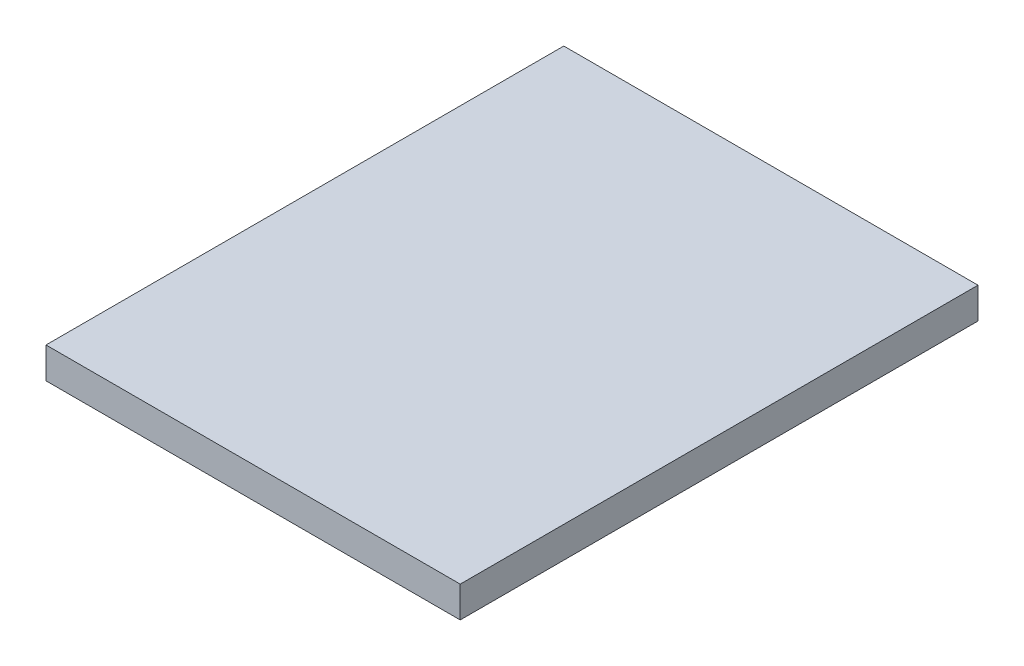
ISO-10303-21;
HEADER;
FILE_DESCRIPTION(('STEP AP214'),'2;1');
FILE_NAME('part.step','',(''),(''),'','','');
FILE_SCHEMA(('AUTOMOTIVE_DESIGN { 1 0 10303 214 1 1 1 1 }'));
ENDSEC;
DATA;
#1=APPLICATION_CONTEXT('core data for automotive mechanical design processes');
#2=APPLICATION_PROTOCOL_DEFINITION('international standard','automotive_design',2000,#1);
#3=PRODUCT_CONTEXT('',#1,'mechanical');
#4=PRODUCT('Part','Part','',(#3));
#5=PRODUCT_RELATED_PRODUCT_CATEGORY('part','',(#4));
#6=PRODUCT_DEFINITION_FORMATION('','',#4);
#7=PRODUCT_DEFINITION_CONTEXT('part definition',#1,'design');
#8=PRODUCT_DEFINITION('design','',#6,#7);
#9=PRODUCT_DEFINITION_SHAPE('','',#8);
#10=(LENGTH_UNIT() NAMED_UNIT(*) SI_UNIT(.MILLI.,.METRE.));
#11=(NAMED_UNIT(*) PLANE_ANGLE_UNIT() SI_UNIT($,.RADIAN.));
#12=(NAMED_UNIT(*) SI_UNIT($,.STERADIAN.) SOLID_ANGLE_UNIT());
#13=UNCERTAINTY_MEASURE_WITH_UNIT(LENGTH_MEASURE(1.E-05),#10,'distance_accuracy_value','');
#14=(GEOMETRIC_REPRESENTATION_CONTEXT(3) GLOBAL_UNCERTAINTY_ASSIGNED_CONTEXT((#13)) GLOBAL_UNIT_ASSIGNED_CONTEXT((#10,
#11,#12)) REPRESENTATION_CONTEXT('',''));
#15=CARTESIAN_POINT('',(0.,0.,0.));
#16=DIRECTION('',(0.,0.,1.));
#17=DIRECTION('',(1.,0.,0.));
#18=AXIS2_PLACEMENT_3D('',#15,#16,#17);
#19=CARTESIAN_POINT('',(0.,6.,0.));
#20=DIRECTION('',(1.,0.,0.));
#21=DIRECTION('',(0.,0.,-1.));
#22=AXIS2_PLACEMENT_3D('',#19,#20,#21);
#23=PLANE('',#22);
#24=DIRECTION('',(0.,0.,1.));
#25=VECTOR('',#24,1.);
#26=CARTESIAN_POINT('',(0.,0.,0.));
#27=LINE('',#26,#25);
#28=CARTESIAN_POINT('',(0.,0.,-100.));
#29=VERTEX_POINT('',#28);
#30=CARTESIAN_POINT('',(0.,0.,0.));
#31=VERTEX_POINT('',#30);
#32=EDGE_CURVE('E97',#29,#31,#27,.T.);
#33=ORIENTED_EDGE('',*,*,#32,.T.);
#34=DIRECTION('',(0.,-1.,0.));
#35=VECTOR('',#34,1.);
#36=CARTESIAN_POINT('',(0.,6.,0.));
#37=LINE('',#36,#35);
#38=CARTESIAN_POINT('',(0.,6.,0.));
#39=VERTEX_POINT('',#38);
#40=EDGE_CURVE('E11',#39,#31,#37,.T.);
#41=ORIENTED_EDGE('',*,*,#40,.F.);
#42=DIRECTION('',(0.,0.,1.));
#43=VECTOR('',#42,1.);
#44=CARTESIAN_POINT('',(0.,6.,0.));
#45=LINE('',#44,#43);
#46=CARTESIAN_POINT('',(0.,6.,-100.));
#47=VERTEX_POINT('',#46);
#48=EDGE_CURVE('E85',#47,#39,#45,.T.);
#49=ORIENTED_EDGE('',*,*,#48,.F.);
#50=DIRECTION('',(0.,-1.,0.));
#51=VECTOR('',#50,1.);
#52=CARTESIAN_POINT('',(0.,6.,-100.));
#53=LINE('',#52,#51);
#54=EDGE_CURVE('E93',#47,#29,#53,.T.);
#55=ORIENTED_EDGE('',*,*,#54,.T.);
#56=EDGE_LOOP('',(#33,#41,#49,#55));
#57=FACE_BOUND('',#56,.T.);
#58=ADVANCED_FACE('F34',(#57),#23,.F.);
#59=CARTESIAN_POINT('',(0.,6.,0.));
#60=DIRECTION('',(0.,0.,-1.));
#61=DIRECTION('',(-1.,0.,0.));
#62=AXIS2_PLACEMENT_3D('',#59,#60,#61);
#63=PLANE('',#62);
#64=DIRECTION('',(1.,0.,0.));
#65=VECTOR('',#64,1.);
#66=CARTESIAN_POINT('',(0.,0.,0.));
#67=LINE('',#66,#65);
#68=CARTESIAN_POINT('',(80.,0.,0.));
#69=VERTEX_POINT('',#68);
#70=EDGE_CURVE('E89',#31,#69,#67,.T.);
#71=ORIENTED_EDGE('',*,*,#70,.T.);
#72=DIRECTION('',(0.,-1.,0.));
#73=VECTOR('',#72,1.);
#74=CARTESIAN_POINT('',(80.,6.,0.));
#75=LINE('',#74,#73);
#76=CARTESIAN_POINT('',(80.,6.,0.));
#77=VERTEX_POINT('',#76);
#78=EDGE_CURVE('E42',#77,#69,#75,.T.);
#79=ORIENTED_EDGE('',*,*,#78,.F.);
#80=DIRECTION('',(1.,0.,0.));
#81=VECTOR('',#80,1.);
#82=CARTESIAN_POINT('',(0.,6.,0.));
#83=LINE('',#82,#81);
#84=EDGE_CURVE('E80',#39,#77,#83,.T.);
#85=ORIENTED_EDGE('',*,*,#84,.F.);
#86=ORIENTED_EDGE('',*,*,#40,.T.);
#87=EDGE_LOOP('',(#71,#79,#85,#86));
#88=FACE_BOUND('',#87,.T.);
#89=ADVANCED_FACE('F88',(#88),#63,.F.);
#90=CARTESIAN_POINT('',(80.,6.,0.));
#91=DIRECTION('',(-1.,0.,0.));
#92=DIRECTION('',(0.,0.,1.));
#93=AXIS2_PLACEMENT_3D('',#90,#91,#92);
#94=PLANE('',#93);
#95=DIRECTION('',(0.,0.,-1.));
#96=VECTOR('',#95,1.);
#97=CARTESIAN_POINT('',(80.,0.,0.));
#98=LINE('',#97,#96);
#99=CARTESIAN_POINT('',(80.,0.,-100.));
#100=VERTEX_POINT('',#99);
#101=EDGE_CURVE('E67',#69,#100,#98,.T.);
#102=ORIENTED_EDGE('',*,*,#101,.T.);
#103=DIRECTION('',(0.,-1.,0.));
#104=VECTOR('',#103,1.);
#105=CARTESIAN_POINT('',(80.,6.,-100.));
#106=LINE('',#105,#104);
#107=CARTESIAN_POINT('',(80.,6.,-100.));
#108=VERTEX_POINT('',#107);
#109=EDGE_CURVE('E90',#108,#100,#106,.T.);
#110=ORIENTED_EDGE('',*,*,#109,.F.);
#111=DIRECTION('',(0.,0.,-1.));
#112=VECTOR('',#111,1.);
#113=CARTESIAN_POINT('',(80.,6.,0.));
#114=LINE('',#113,#112);
#115=EDGE_CURVE('E83',#77,#108,#114,.T.);
#116=ORIENTED_EDGE('',*,*,#115,.F.);
#117=ORIENTED_EDGE('',*,*,#78,.T.);
#118=EDGE_LOOP('',(#102,#110,#116,#117));
#119=FACE_BOUND('',#118,.T.);
#120=ADVANCED_FACE('F91',(#119),#94,.F.);
#121=CARTESIAN_POINT('',(0.,6.,-100.));
#122=DIRECTION('',(0.,0.,1.));
#123=DIRECTION('',(1.,0.,0.));
#124=AXIS2_PLACEMENT_3D('',#121,#122,#123);
#125=PLANE('',#124);
#126=DIRECTION('',(-1.,0.,0.));
#127=VECTOR('',#126,1.);
#128=CARTESIAN_POINT('',(0.,0.,-100.));
#129=LINE('',#128,#127);
#130=EDGE_CURVE('E73',#100,#29,#129,.T.);
#131=ORIENTED_EDGE('',*,*,#130,.T.);
#132=ORIENTED_EDGE('',*,*,#54,.F.);
#133=DIRECTION('',(-1.,0.,0.));
#134=VECTOR('',#133,1.);
#135=CARTESIAN_POINT('',(0.,6.,-100.));
#136=LINE('',#135,#134);
#137=EDGE_CURVE('E50',#108,#47,#136,.T.);
#138=ORIENTED_EDGE('',*,*,#137,.F.);
#139=ORIENTED_EDGE('',*,*,#109,.T.);
#140=EDGE_LOOP('',(#131,#132,#138,#139));
#141=FACE_BOUND('',#140,.T.);
#142=ADVANCED_FACE('F104',(#141),#125,.F.);
#143=CARTESIAN_POINT('',(0.,6.,0.));
#144=DIRECTION('',(0.,-1.,0.));
#145=DIRECTION('',(0.,0.,-1.));
#146=AXIS2_PLACEMENT_3D('',#143,#144,#145);
#147=PLANE('',#146);
#148=ORIENTED_EDGE('',*,*,#48,.T.);
#149=ORIENTED_EDGE('',*,*,#84,.T.);
#150=ORIENTED_EDGE('',*,*,#115,.T.);
#151=ORIENTED_EDGE('',*,*,#137,.T.);
#152=EDGE_LOOP('',(#148,#149,#150,#151));
#153=FACE_BOUND('',#152,.T.);
#154=ADVANCED_FACE('F81',(#153),#147,.F.);
#155=CARTESIAN_POINT('',(0.,0.,0.));
#156=DIRECTION('',(0.,-1.,0.));
#157=DIRECTION('',(0.,0.,-1.));
#158=AXIS2_PLACEMENT_3D('',#155,#156,#157);
#159=PLANE('',#158);
#160=ORIENTED_EDGE('',*,*,#32,.F.);
#161=ORIENTED_EDGE('',*,*,#130,.F.);
#162=ORIENTED_EDGE('',*,*,#101,.F.);
#163=ORIENTED_EDGE('',*,*,#70,.F.);
#164=EDGE_LOOP('',(#160,#161,#162,#163));
#165=FACE_BOUND('',#164,.T.);
#166=ADVANCED_FACE('F107',(#165),#159,.T.);
#167=CLOSED_SHELL('',(#58,#89,#120,#142,#154,#166));
#168=MANIFOLD_SOLID_BREP('B2',#167);
#169=ADVANCED_BREP_SHAPE_REPRESENTATION('',(#18,#168),#14);
#170=SHAPE_DEFINITION_REPRESENTATION(#9,#169);
ENDSEC;
END-ISO-10303-21;
